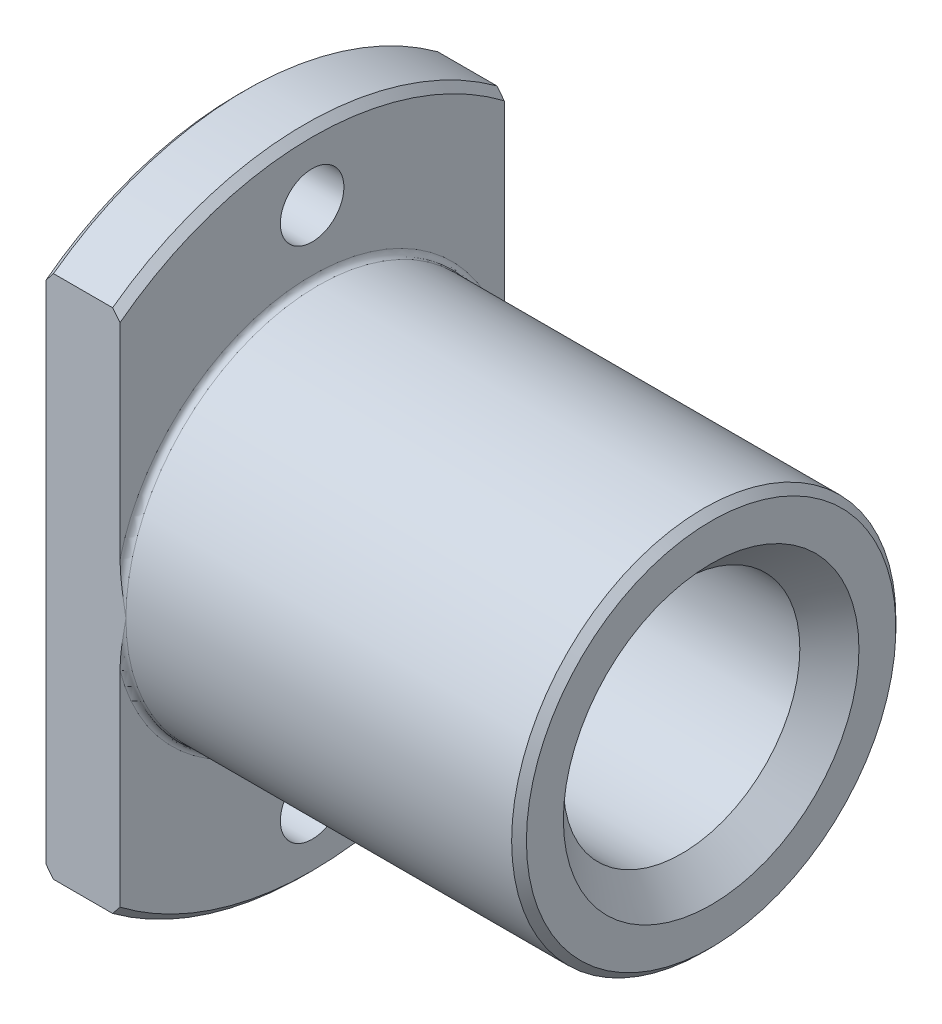
ISO-10303-21;
HEADER;
FILE_DESCRIPTION(('STEP AP214'),'2;1');
FILE_NAME('part.step','',(''),(''),'','','');
FILE_SCHEMA(('AUTOMOTIVE_DESIGN { 1 0 10303 214 1 1 1 1 }'));
ENDSEC;
DATA;
#1=APPLICATION_CONTEXT('core data for automotive mechanical design processes');
#2=APPLICATION_PROTOCOL_DEFINITION('international standard','automotive_design',2000,#1);
#3=PRODUCT_CONTEXT('',#1,'mechanical');
#4=PRODUCT('Part','Part','',(#3));
#5=PRODUCT_RELATED_PRODUCT_CATEGORY('part','',(#4));
#6=PRODUCT_DEFINITION_FORMATION('','',#4);
#7=PRODUCT_DEFINITION_CONTEXT('part definition',#1,'design');
#8=PRODUCT_DEFINITION('design','',#6,#7);
#9=PRODUCT_DEFINITION_SHAPE('','',#8);
#10=(LENGTH_UNIT() NAMED_UNIT(*) SI_UNIT(.MILLI.,.METRE.));
#11=(NAMED_UNIT(*) PLANE_ANGLE_UNIT() SI_UNIT($,.RADIAN.));
#12=(NAMED_UNIT(*) SI_UNIT($,.STERADIAN.) SOLID_ANGLE_UNIT());
#13=UNCERTAINTY_MEASURE_WITH_UNIT(LENGTH_MEASURE(1.E-05),#10,'distance_accuracy_value','');
#14=(GEOMETRIC_REPRESENTATION_CONTEXT(3) GLOBAL_UNCERTAINTY_ASSIGNED_CONTEXT((#13)) GLOBAL_UNIT_ASSIGNED_CONTEXT((#10,
#11,#12)) REPRESENTATION_CONTEXT('',''));
#15=CARTESIAN_POINT('',(0.,0.,0.));
#16=DIRECTION('',(0.,0.,1.));
#17=DIRECTION('',(1.,0.,0.));
#18=AXIS2_PLACEMENT_3D('',#15,#16,#17);
#19=CARTESIAN_POINT('',(16.,0.,0.));
#20=DIRECTION('',(1.,0.,0.));
#21=DIRECTION('',(0.,0.,-1.));
#22=AXIS2_PLACEMENT_3D('',#19,#20,#21);
#23=CYLINDRICAL_SURFACE('',#22,8.);
#24=CARTESIAN_POINT('',(30.,0.,0.));
#25=DIRECTION('',(1.,0.,0.));
#26=DIRECTION('',(0.,1.,0.));
#27=AXIS2_PLACEMENT_3D('',#24,#25,#26);
#28=CIRCLE('',#27,8.);
#29=CARTESIAN_POINT('',(30.,8.,0.));
#30=VERTEX_POINT('',#29);
#31=EDGE_CURVE('E170',#30,#30,#28,.T.);
#32=ORIENTED_EDGE('',*,*,#31,.T.);
#33=EDGE_LOOP('',(#32));
#34=FACE_BOUND('',#33,.T.);
#35=CARTESIAN_POINT('',(2.,0.,0.));
#36=DIRECTION('',(-1.,0.,0.));
#37=DIRECTION('',(0.,1.,0.));
#38=AXIS2_PLACEMENT_3D('',#35,#36,#37);
#39=CIRCLE('',#38,8.);
#40=CARTESIAN_POINT('',(2.,8.,0.));
#41=VERTEX_POINT('',#40);
#42=EDGE_CURVE('E114',#41,#41,#39,.T.);
#43=ORIENTED_EDGE('',*,*,#42,.T.);
#44=EDGE_LOOP('',(#43));
#45=FACE_BOUND('',#44,.T.);
#46=ADVANCED_FACE('F17',(#34,#45),#23,.F.);
#47=CARTESIAN_POINT('',(0.,0.,0.));
#48=DIRECTION('',(-1.,0.,0.));
#49=DIRECTION('',(0.,0.,1.));
#50=AXIS2_PLACEMENT_3D('',#47,#48,#49);
#51=CONICAL_SURFACE('',#50,10.,0.785398163397448);
#52=CARTESIAN_POINT('',(0.,0.,0.));
#53=DIRECTION('',(-1.,0.,0.));
#54=DIRECTION('',(0.,0.,1.));
#55=AXIS2_PLACEMENT_3D('',#52,#53,#54);
#56=CIRCLE('',#55,10.);
#57=CARTESIAN_POINT('',(0.,0.,10.));
#58=VERTEX_POINT('',#57);
#59=EDGE_CURVE('E213',#58,#58,#56,.F.);
#60=ORIENTED_EDGE('',*,*,#59,.F.);
#61=EDGE_LOOP('',(#60));
#62=FACE_BOUND('',#61,.T.);
#63=ORIENTED_EDGE('',*,*,#42,.F.);
#64=EDGE_LOOP('',(#63));
#65=FACE_BOUND('',#64,.T.);
#66=ADVANCED_FACE('F265',(#62,#65),#51,.F.);
#67=CARTESIAN_POINT('',(0.49999999999998,0.,0.));
#68=DIRECTION('',(1.,0.,0.));
#69=DIRECTION('',(0.,0.,-1.));
#70=AXIS2_PLACEMENT_3D('',#67,#68,#69);
#71=CONICAL_SURFACE('',#70,22.,0.785398163397448);
#72=CARTESIAN_POINT('',(0.,-17.1245437895437,-13.));
#73=CARTESIAN_POINT('',(0.0830091371064529,-17.2287529536946,-13.));
#74=CARTESIAN_POINT('',(0.166180373495549,-17.3328321671988,-13.));
#75=CARTESIAN_POINT('',(0.332847040180335,-17.5407306871027,-13.));
#76=CARTESIAN_POINT('',(0.4163424704579,-17.6445499935168,-13.));
#77=CARTESIAN_POINT('',(0.499999999999983,-17.7482393492988,-13.));
#78=B_SPLINE_CURVE_WITH_KNOTS('',3,(#72,#73,#74,#75,#76,#77),.UNSPECIFIED.,.F.,.F.,(4,2,4),(0.,
0.399686671300564,0.799373320256933),.UNSPECIFIED.);
#79=CARTESIAN_POINT('',(0.,-17.1245437895437,-13.));
#80=VERTEX_POINT('',#79);
#81=CARTESIAN_POINT('',(0.499999999999991,-17.7482393492988,-13.));
#82=VERTEX_POINT('',#81);
#83=EDGE_CURVE('E248',#80,#82,#78,.T.);
#84=ORIENTED_EDGE('',*,*,#83,.T.);
#85=CARTESIAN_POINT('',(0.5,0.,0.));
#86=DIRECTION('',(1.,0.,0.));
#87=DIRECTION('',(0.,0.,-1.));
#88=AXIS2_PLACEMENT_3D('',#85,#86,#87);
#89=CIRCLE('',#88,22.);
#90=CARTESIAN_POINT('',(0.499999999999989,-17.7482393492988,13.));
#91=VERTEX_POINT('',#90);
#92=EDGE_CURVE('E103',#91,#82,#89,.T.);
#93=ORIENTED_EDGE('',*,*,#92,.F.);
#94=CARTESIAN_POINT('',(0.499999999999979,-17.7482393492988,13.));
#95=CARTESIAN_POINT('',(0.416342470457896,-17.6445499935168,13.));
#96=CARTESIAN_POINT('',(0.332847040180329,-17.5407306871027,13.));
#97=CARTESIAN_POINT('',(0.166180373495543,-17.3328321671988,13.));
#98=CARTESIAN_POINT('',(0.0830091371064473,-17.2287529536946,13.));
#99=CARTESIAN_POINT('',(0.,-17.1245437895437,13.));
#100=B_SPLINE_CURVE_WITH_KNOTS('',3,(#94,#95,#96,#97,#98,#99),.UNSPECIFIED.,.F.,.F.,(4,2,4),(0.,
0.399686648956371,0.799373320256931),.UNSPECIFIED.);
#101=CARTESIAN_POINT('',(0.,-17.1245437895437,13.));
#102=VERTEX_POINT('',#101);
#103=EDGE_CURVE('E20',#91,#102,#100,.T.);
#104=ORIENTED_EDGE('',*,*,#103,.T.);
#105=CARTESIAN_POINT('',(0.,0.,0.));
#106=DIRECTION('',(1.,0.,0.));
#107=DIRECTION('',(0.,0.,-1.));
#108=AXIS2_PLACEMENT_3D('',#105,#106,#107);
#109=CIRCLE('',#108,21.5);
#110=EDGE_CURVE('E107',#80,#102,#109,.F.);
#111=ORIENTED_EDGE('',*,*,#110,.F.);
#112=EDGE_LOOP('',(#84,#93,#104,#111));
#113=FACE_BOUND('',#112,.T.);
#114=ADVANCED_FACE('F106',(#113),#71,.T.);
#115=CARTESIAN_POINT('',(0.500000000000001,0.,0.));
#116=DIRECTION('',(1.,0.,0.));
#117=DIRECTION('',(0.,0.,-1.));
#118=AXIS2_PLACEMENT_3D('',#115,#116,#117);
#119=CONICAL_SURFACE('',#118,22.,0.785398163397447);
#120=CARTESIAN_POINT('',(0.499999999999981,17.7482393492988,-13.));
#121=CARTESIAN_POINT('',(0.416342470457898,17.6445499935168,-13.));
#122=CARTESIAN_POINT('',(0.332847040180332,17.5407306871027,-13.));
#123=CARTESIAN_POINT('',(0.166180373495547,17.3328321671988,-13.));
#124=CARTESIAN_POINT('',(0.0830091371064509,17.2287529536946,-13.));
#125=CARTESIAN_POINT('',(0.,17.1245437895437,-13.));
#126=B_SPLINE_CURVE_WITH_KNOTS('',3,(#120,#121,#122,#123,#124,#125),.UNSPECIFIED.,.F.,.F.,(4,2,
4),(0.,0.39968664895637,0.79937332025693),.UNSPECIFIED.);
#127=CARTESIAN_POINT('',(0.49999999999999,17.7482393492988,-13.));
#128=VERTEX_POINT('',#127);
#129=CARTESIAN_POINT('',(0.,17.1245437895437,-13.));
#130=VERTEX_POINT('',#129);
#131=EDGE_CURVE('E174',#128,#130,#126,.T.);
#132=ORIENTED_EDGE('',*,*,#131,.T.);
#133=CARTESIAN_POINT('',(0.,0.,0.));
#134=DIRECTION('',(1.,0.,0.));
#135=DIRECTION('',(0.,0.,-1.));
#136=AXIS2_PLACEMENT_3D('',#133,#134,#135);
#137=CIRCLE('',#136,21.5);
#138=CARTESIAN_POINT('',(0.,17.1245437895437,13.));
#139=VERTEX_POINT('',#138);
#140=EDGE_CURVE('E124',#139,#130,#137,.F.);
#141=ORIENTED_EDGE('',*,*,#140,.F.);
#142=CARTESIAN_POINT('',(0.,17.1245437895437,13.));
#143=CARTESIAN_POINT('',(0.0830091371064499,17.2287529536946,13.));
#144=CARTESIAN_POINT('',(0.166180373495545,17.3328321671988,13.));
#145=CARTESIAN_POINT('',(0.33284704018033,17.5407306871027,13.));
#146=CARTESIAN_POINT('',(0.416342470457896,17.6445499935168,13.));
#147=CARTESIAN_POINT('',(0.49999999999998,17.7482393492988,13.));
#148=B_SPLINE_CURVE_WITH_KNOTS('',3,(#142,#143,#144,#145,#146,#147),.UNSPECIFIED.,.F.,.F.,(4,2,
4),(0.,0.399686671300559,0.799373320256933),.UNSPECIFIED.);
#149=CARTESIAN_POINT('',(0.499999999999989,17.7482393492988,13.));
#150=VERTEX_POINT('',#149);
#151=EDGE_CURVE('E113',#139,#150,#148,.T.);
#152=ORIENTED_EDGE('',*,*,#151,.T.);
#153=CARTESIAN_POINT('',(0.5,0.,0.));
#154=DIRECTION('',(1.,0.,0.));
#155=DIRECTION('',(0.,0.,-1.));
#156=AXIS2_PLACEMENT_3D('',#153,#154,#155);
#157=CIRCLE('',#156,22.);
#158=EDGE_CURVE('E150',#128,#150,#157,.T.);
#159=ORIENTED_EDGE('',*,*,#158,.F.);
#160=EDGE_LOOP('',(#132,#141,#152,#159));
#161=FACE_BOUND('',#160,.T.);
#162=ADVANCED_FACE('F256',(#161),#119,.T.);
#163=CARTESIAN_POINT('',(32.,0.,0.));
#164=DIRECTION('',(1.,0.,0.));
#165=DIRECTION('',(0.,0.,-1.));
#166=AXIS2_PLACEMENT_3D('',#163,#164,#165);
#167=CONICAL_SURFACE('',#166,10.,0.785398163397448);
#168=CARTESIAN_POINT('',(32.,0.,0.));
#169=DIRECTION('',(1.,0.,0.));
#170=DIRECTION('',(0.,0.,-1.));
#171=AXIS2_PLACEMENT_3D('',#168,#169,#170);
#172=CIRCLE('',#171,10.);
#173=CARTESIAN_POINT('',(32.,0.,-10.));
#174=VERTEX_POINT('',#173);
#175=EDGE_CURVE('E160',#174,#174,#172,.F.);
#176=ORIENTED_EDGE('',*,*,#175,.F.);
#177=EDGE_LOOP('',(#176));
#178=FACE_BOUND('',#177,.T.);
#179=ORIENTED_EDGE('',*,*,#31,.F.);
#180=EDGE_LOOP('',(#179));
#181=FACE_BOUND('',#180,.T.);
#182=ADVANCED_FACE('F260',(#178,#181),#167,.F.);
#183=CARTESIAN_POINT('',(4.5,0.,0.));
#184=DIRECTION('',(-1.,0.,0.));
#185=DIRECTION('',(0.,0.,1.));
#186=AXIS2_PLACEMENT_3D('',#183,#184,#185);
#187=CONICAL_SURFACE('',#186,22.,0.785398163397447);
#188=CARTESIAN_POINT('',(4.50000000000002,-17.7482393492988,-13.));
#189=CARTESIAN_POINT('',(4.5836575295421,-17.6445499935168,-13.));
#190=CARTESIAN_POINT('',(4.66715295981967,-17.5407306871027,-13.));
#191=CARTESIAN_POINT('',(4.83381962650446,-17.3328321671988,-13.));
#192=CARTESIAN_POINT('',(4.91699086289355,-17.2287529536946,-13.));
#193=CARTESIAN_POINT('',(5.00000000000001,-17.1245437895437,-13.));
#194=B_SPLINE_CURVE_WITH_KNOTS('',3,(#188,#189,#190,#191,#192,#193),.UNSPECIFIED.,.F.,.F.,(4,2,
4),(0.,0.399686648956371,0.799373320256932),.UNSPECIFIED.);
#195=CARTESIAN_POINT('',(4.50000000000001,-17.7482393492988,-13.));
#196=VERTEX_POINT('',#195);
#197=CARTESIAN_POINT('',(5.,-17.1245437895437,-13.));
#198=VERTEX_POINT('',#197);
#199=EDGE_CURVE('E214',#196,#198,#194,.T.);
#200=ORIENTED_EDGE('',*,*,#199,.T.);
#201=CARTESIAN_POINT('',(5.,0.,0.));
#202=DIRECTION('',(-1.,0.,0.));
#203=DIRECTION('',(0.,0.,1.));
#204=AXIS2_PLACEMENT_3D('',#201,#202,#203);
#205=CIRCLE('',#204,21.5);
#206=CARTESIAN_POINT('',(5.,-17.1245437895437,13.));
#207=VERTEX_POINT('',#206);
#208=EDGE_CURVE('E283',#207,#198,#205,.F.);
#209=ORIENTED_EDGE('',*,*,#208,.F.);
#210=CARTESIAN_POINT('',(5.00000000000001,-17.1245437895437,13.));
#211=CARTESIAN_POINT('',(4.91699086289355,-17.2287529536946,13.));
#212=CARTESIAN_POINT('',(4.83381962650446,-17.3328321671988,13.));
#213=CARTESIAN_POINT('',(4.66715295981967,-17.5407306871027,13.));
#214=CARTESIAN_POINT('',(4.5836575295421,-17.6445499935168,13.));
#215=CARTESIAN_POINT('',(4.50000000000002,-17.7482393492988,13.));
#216=B_SPLINE_CURVE_WITH_KNOTS('',3,(#210,#211,#212,#213,#214,#215),.UNSPECIFIED.,.F.,.F.,(4,2,
4),(0.,0.39968667130056,0.799373320256934),.UNSPECIFIED.);
#217=CARTESIAN_POINT('',(4.50000000000001,-17.7482393492988,13.));
#218=VERTEX_POINT('',#217);
#219=EDGE_CURVE('E173',#207,#218,#216,.T.);
#220=ORIENTED_EDGE('',*,*,#219,.T.);
#221=CARTESIAN_POINT('',(4.5,0.,0.));
#222=DIRECTION('',(1.,0.,0.));
#223=DIRECTION('',(0.,0.,-1.));
#224=AXIS2_PLACEMENT_3D('',#221,#222,#223);
#225=CIRCLE('',#224,22.);
#226=EDGE_CURVE('E151',#196,#218,#225,.F.);
#227=ORIENTED_EDGE('',*,*,#226,.F.);
#228=EDGE_LOOP('',(#200,#209,#220,#227));
#229=FACE_BOUND('',#228,.T.);
#230=ADVANCED_FACE('F281',(#229),#187,.T.);
#231=CARTESIAN_POINT('',(2.5,-17.5,0.));
#232=DIRECTION('',(1.,0.,0.));
#233=DIRECTION('',(0.,0.,-1.));
#234=AXIS2_PLACEMENT_3D('',#231,#232,#233);
#235=CYLINDRICAL_SURFACE('',#234,2.15);
#236=CARTESIAN_POINT('',(5.,-17.5,0.));
#237=DIRECTION('',(1.,0.,0.));
#238=DIRECTION('',(0.,0.,-1.));
#239=AXIS2_PLACEMENT_3D('',#236,#237,#238);
#240=CIRCLE('',#239,2.15);
#241=CARTESIAN_POINT('',(5.,-17.5,-2.15));
#242=VERTEX_POINT('',#241);
#243=EDGE_CURVE('E146',#242,#242,#240,.F.);
#244=ORIENTED_EDGE('',*,*,#243,.F.);
#245=EDGE_LOOP('',(#244));
#246=FACE_BOUND('',#245,.T.);
#247=CARTESIAN_POINT('',(0.,-17.5,0.));
#248=DIRECTION('',(1.,0.,0.));
#249=DIRECTION('',(0.,0.,-1.));
#250=AXIS2_PLACEMENT_3D('',#247,#248,#249);
#251=CIRCLE('',#250,2.15);
#252=CARTESIAN_POINT('',(0.,-17.5,-2.15));
#253=VERTEX_POINT('',#252);
#254=EDGE_CURVE('E125',#253,#253,#251,.T.);
#255=ORIENTED_EDGE('',*,*,#254,.F.);
#256=EDGE_LOOP('',(#255));
#257=FACE_BOUND('',#256,.T.);
#258=ADVANCED_FACE('F467',(#246,#257),#235,.F.);
#259=CARTESIAN_POINT('',(2.5,17.5,0.));
#260=DIRECTION('',(1.,0.,0.));
#261=DIRECTION('',(0.,0.,-1.));
#262=AXIS2_PLACEMENT_3D('',#259,#260,#261);
#263=CYLINDRICAL_SURFACE('',#262,2.15);
#264=CARTESIAN_POINT('',(5.,17.5,0.));
#265=DIRECTION('',(1.,0.,0.));
#266=DIRECTION('',(0.,0.,-1.));
#267=AXIS2_PLACEMENT_3D('',#264,#265,#266);
#268=CIRCLE('',#267,2.15);
#269=CARTESIAN_POINT('',(5.,17.5,-2.15));
#270=VERTEX_POINT('',#269);
#271=EDGE_CURVE('E131',#270,#270,#268,.F.);
#272=ORIENTED_EDGE('',*,*,#271,.F.);
#273=EDGE_LOOP('',(#272));
#274=FACE_BOUND('',#273,.T.);
#275=CARTESIAN_POINT('',(0.,17.5,0.));
#276=DIRECTION('',(1.,0.,0.));
#277=DIRECTION('',(0.,0.,-1.));
#278=AXIS2_PLACEMENT_3D('',#275,#276,#277);
#279=CIRCLE('',#278,2.15);
#280=CARTESIAN_POINT('',(0.,17.5,-2.15));
#281=VERTEX_POINT('',#280);
#282=EDGE_CURVE('E444',#281,#281,#279,.T.);
#283=ORIENTED_EDGE('',*,*,#282,.F.);
#284=EDGE_LOOP('',(#283));
#285=FACE_BOUND('',#284,.T.);
#286=ADVANCED_FACE('F200',(#274,#285),#263,.F.);
#287=CARTESIAN_POINT('',(4.5,0.,0.));
#288=DIRECTION('',(-1.,0.,0.));
#289=DIRECTION('',(0.,0.,1.));
#290=AXIS2_PLACEMENT_3D('',#287,#288,#289);
#291=CONICAL_SURFACE('',#290,22.,0.785398163397447);
#292=CARTESIAN_POINT('',(4.50000000000002,17.7482393492988,13.));
#293=CARTESIAN_POINT('',(4.5836575295421,17.6445499935168,13.));
#294=CARTESIAN_POINT('',(4.66715295981967,17.5407306871027,13.));
#295=CARTESIAN_POINT('',(4.83381962650446,17.3328321671988,13.));
#296=CARTESIAN_POINT('',(4.91699086289355,17.2287529536946,13.));
#297=CARTESIAN_POINT('',(5.00000000000001,17.1245437895437,13.));
#298=B_SPLINE_CURVE_WITH_KNOTS('',3,(#292,#293,#294,#295,#296,#297),.UNSPECIFIED.,.F.,.F.,(4,2,
4),(0.,0.399686648956371,0.799373320256932),.UNSPECIFIED.);
#299=CARTESIAN_POINT('',(4.50000000000002,17.7482393492988,13.));
#300=VERTEX_POINT('',#299);
#301=CARTESIAN_POINT('',(5.,17.1245437895437,13.));
#302=VERTEX_POINT('',#301);
#303=EDGE_CURVE('E145',#300,#302,#298,.T.);
#304=ORIENTED_EDGE('',*,*,#303,.T.);
#305=CARTESIAN_POINT('',(5.,0.,0.));
#306=DIRECTION('',(-1.,0.,0.));
#307=DIRECTION('',(0.,0.,1.));
#308=AXIS2_PLACEMENT_3D('',#305,#306,#307);
#309=CIRCLE('',#308,21.5);
#310=CARTESIAN_POINT('',(5.,17.1245437895437,-13.));
#311=VERTEX_POINT('',#310);
#312=EDGE_CURVE('E135',#311,#302,#309,.F.);
#313=ORIENTED_EDGE('',*,*,#312,.F.);
#314=CARTESIAN_POINT('',(5.00000000000001,17.1245437895437,-13.));
#315=CARTESIAN_POINT('',(4.91699086289355,17.2287529536946,-13.));
#316=CARTESIAN_POINT('',(4.83381962650446,17.3328321671988,-13.));
#317=CARTESIAN_POINT('',(4.66715295981967,17.5407306871027,-13.));
#318=CARTESIAN_POINT('',(4.5836575295421,17.6445499935168,-13.));
#319=CARTESIAN_POINT('',(4.50000000000002,17.7482393492988,-13.));
#320=B_SPLINE_CURVE_WITH_KNOTS('',3,(#314,#315,#316,#317,#318,#319),.UNSPECIFIED.,.F.,.F.,(4,2,
4),(0.,0.39968667130056,0.799373320256934),.UNSPECIFIED.);
#321=CARTESIAN_POINT('',(4.50000000000001,17.7482393492988,-13.));
#322=VERTEX_POINT('',#321);
#323=EDGE_CURVE('E206',#311,#322,#320,.T.);
#324=ORIENTED_EDGE('',*,*,#323,.T.);
#325=CARTESIAN_POINT('',(4.5,0.,0.));
#326=DIRECTION('',(1.,0.,0.));
#327=DIRECTION('',(0.,0.,-1.));
#328=AXIS2_PLACEMENT_3D('',#325,#326,#327);
#329=CIRCLE('',#328,22.);
#330=EDGE_CURVE('E147',#300,#322,#329,.F.);
#331=ORIENTED_EDGE('',*,*,#330,.F.);
#332=EDGE_LOOP('',(#304,#313,#324,#331));
#333=FACE_BOUND('',#332,.T.);
#334=ADVANCED_FACE('F195',(#333),#291,.T.);
#335=CARTESIAN_POINT('',(0.,10.75,0.));
#336=DIRECTION('',(-1.,0.,0.));
#337=DIRECTION('',(0.,0.,1.));
#338=AXIS2_PLACEMENT_3D('',#335,#336,#337);
#339=PLANE('',#338);
#340=DIRECTION('',(0.,1.,0.));
#341=VECTOR('',#340,1.);
#342=CARTESIAN_POINT('',(0.,22.,13.));
#343=LINE('',#342,#341);
#344=EDGE_CURVE('E121',#102,#139,#343,.T.);
#345=ORIENTED_EDGE('',*,*,#344,.T.);
#346=ORIENTED_EDGE('',*,*,#140,.T.);
#347=DIRECTION('',(0.,1.,0.));
#348=VECTOR('',#347,1.);
#349=CARTESIAN_POINT('',(0.,-22.,-13.));
#350=LINE('',#349,#348);
#351=EDGE_CURVE('E123',#130,#80,#350,.F.);
#352=ORIENTED_EDGE('',*,*,#351,.T.);
#353=ORIENTED_EDGE('',*,*,#110,.T.);
#354=EDGE_LOOP('',(#345,#346,#352,#353));
#355=FACE_BOUND('',#354,.T.);
#356=ORIENTED_EDGE('',*,*,#254,.T.);
#357=EDGE_LOOP('',(#356));
#358=FACE_BOUND('',#357,.T.);
#359=ORIENTED_EDGE('',*,*,#282,.T.);
#360=EDGE_LOOP('',(#359));
#361=FACE_BOUND('',#360,.T.);
#362=ORIENTED_EDGE('',*,*,#59,.T.);
#363=EDGE_LOOP('',(#362));
#364=FACE_BOUND('',#363,.T.);
#365=ADVANCED_FACE('F118',(#355,#358,#361,#364),#339,.T.);
#366=CARTESIAN_POINT('',(2.5,0.,0.));
#367=DIRECTION('',(1.,0.,0.));
#368=DIRECTION('',(0.,0.,-1.));
#369=AXIS2_PLACEMENT_3D('',#366,#367,#368);
#370=CYLINDRICAL_SURFACE('',#369,22.);
#371=DIRECTION('',(1.,0.,0.));
#372=VECTOR('',#371,1.);
#373=CARTESIAN_POINT('',(0.,-17.7482393492988,-13.));
#374=LINE('',#373,#372);
#375=EDGE_CURVE('E166',#82,#196,#374,.T.);
#376=ORIENTED_EDGE('',*,*,#375,.T.);
#377=ORIENTED_EDGE('',*,*,#226,.T.);
#378=DIRECTION('',(-1.,0.,0.));
#379=VECTOR('',#378,1.);
#380=CARTESIAN_POINT('',(0.,-17.7482393492988,13.));
#381=LINE('',#380,#379);
#382=EDGE_CURVE('E132',#218,#91,#381,.T.);
#383=ORIENTED_EDGE('',*,*,#382,.T.);
#384=ORIENTED_EDGE('',*,*,#92,.T.);
#385=EDGE_LOOP('',(#376,#377,#383,#384));
#386=FACE_BOUND('',#385,.T.);
#387=ADVANCED_FACE('F274',(#386),#370,.T.);
#388=CARTESIAN_POINT('',(2.5,0.,0.));
#389=DIRECTION('',(1.,0.,0.));
#390=DIRECTION('',(0.,0.,-1.));
#391=AXIS2_PLACEMENT_3D('',#388,#389,#390);
#392=CYLINDRICAL_SURFACE('',#391,22.);
#393=DIRECTION('',(1.,0.,0.));
#394=VECTOR('',#393,1.);
#395=CARTESIAN_POINT('',(0.,17.7482393492988,-13.));
#396=LINE('',#395,#394);
#397=EDGE_CURVE('E154',#322,#128,#396,.F.);
#398=ORIENTED_EDGE('',*,*,#397,.T.);
#399=ORIENTED_EDGE('',*,*,#158,.T.);
#400=DIRECTION('',(-1.,0.,0.));
#401=VECTOR('',#400,1.);
#402=CARTESIAN_POINT('',(0.,17.7482393492988,13.));
#403=LINE('',#402,#401);
#404=EDGE_CURVE('E142',#150,#300,#403,.F.);
#405=ORIENTED_EDGE('',*,*,#404,.T.);
#406=ORIENTED_EDGE('',*,*,#330,.T.);
#407=EDGE_LOOP('',(#398,#399,#405,#406));
#408=FACE_BOUND('',#407,.T.);
#409=ADVANCED_FACE('F315',(#408),#392,.T.);
#410=CARTESIAN_POINT('',(32.,6.25,0.));
#411=DIRECTION('',(1.,0.,0.));
#412=DIRECTION('',(0.,0.,-1.));
#413=AXIS2_PLACEMENT_3D('',#410,#411,#412);
#414=PLANE('',#413);
#415=CARTESIAN_POINT('',(32.,0.,0.));
#416=DIRECTION('',(-1.,0.,0.));
#417=DIRECTION('',(0.,0.,1.));
#418=AXIS2_PLACEMENT_3D('',#415,#416,#417);
#419=CIRCLE('',#418,12.5);
#420=CARTESIAN_POINT('',(32.,0.,12.5));
#421=VERTEX_POINT('',#420);
#422=EDGE_CURVE('E157',#421,#421,#419,.T.);
#423=ORIENTED_EDGE('',*,*,#422,.F.);
#424=EDGE_LOOP('',(#423));
#425=FACE_BOUND('',#424,.T.);
#426=ORIENTED_EDGE('',*,*,#175,.T.);
#427=EDGE_LOOP('',(#426));
#428=FACE_BOUND('',#427,.T.);
#429=ADVANCED_FACE('F311',(#425,#428),#414,.T.);
#430=CARTESIAN_POINT('',(5.,17.45,0.));
#431=DIRECTION('',(1.,0.,0.));
#432=DIRECTION('',(0.,0.,-1.));
#433=AXIS2_PLACEMENT_3D('',#430,#431,#432);
#434=PLANE('',#433);
#435=ORIENTED_EDGE('',*,*,#243,.T.);
#436=EDGE_LOOP('',(#435));
#437=FACE_BOUND('',#436,.T.);
#438=DIRECTION('',(0.,1.,0.));
#439=VECTOR('',#438,1.);
#440=CARTESIAN_POINT('',(5.,22.,13.));
#441=LINE('',#440,#439);
#442=CARTESIAN_POINT('',(5.,-3.24961536185438,13.));
#443=VERTEX_POINT('',#442);
#444=EDGE_CURVE('E137',#443,#207,#441,.F.);
#445=ORIENTED_EDGE('',*,*,#444,.T.);
#446=ORIENTED_EDGE('',*,*,#208,.T.);
#447=DIRECTION('',(0.,1.,0.));
#448=VECTOR('',#447,1.);
#449=CARTESIAN_POINT('',(5.,-22.,-13.));
#450=LINE('',#449,#448);
#451=CARTESIAN_POINT('',(5.,-3.24961536185438,-13.));
#452=VERTEX_POINT('',#451);
#453=EDGE_CURVE('E168',#198,#452,#450,.T.);
#454=ORIENTED_EDGE('',*,*,#453,.T.);
#455=CARTESIAN_POINT('',(5.,0.,0.));
#456=DIRECTION('',(1.,0.,0.));
#457=DIRECTION('',(0.,-0.242508609093611,0.970149253731343));
#458=AXIS2_PLACEMENT_3D('',#455,#456,#457);
#459=CIRCLE('',#458,13.4);
#460=EDGE_CURVE('E182',#452,#443,#459,.F.);
#461=ORIENTED_EDGE('',*,*,#460,.T.);
#462=EDGE_LOOP('',(#445,#446,#454,#461));
#463=FACE_BOUND('',#462,.T.);
#464=ADVANCED_FACE('F289',(#437,#463),#434,.T.);
#465=CARTESIAN_POINT('',(0.,22.,13.));
#466=DIRECTION('',(0.,0.,-1.));
#467=DIRECTION('',(-1.,0.,0.));
#468=AXIS2_PLACEMENT_3D('',#465,#466,#467);
#469=PLANE('',#468);
#470=ORIENTED_EDGE('',*,*,#344,.F.);
#471=ORIENTED_EDGE('',*,*,#103,.F.);
#472=ORIENTED_EDGE('',*,*,#382,.F.);
#473=ORIENTED_EDGE('',*,*,#219,.F.);
#474=ORIENTED_EDGE('',*,*,#444,.F.);
#475=CARTESIAN_POINT('',(5.4,0.,13.));
#476=CARTESIAN_POINT('',(5.37006605510488,-0.170585754090153,12.9999645803027));
#477=CARTESIAN_POINT('',(5.34002398446141,-0.341160445674433,13.000003598834));
#478=CARTESIAN_POINT('',(5.28526345897468,-0.658551041566375,13.0000930560647));
#479=CARTESIAN_POINT('',(5.26038974676959,-0.805340406595837,13.0001411223467));
#480=CARTESIAN_POINT('',(5.2163259363252,-1.07525008244893,13.0001655001162));
#481=CARTESIAN_POINT('',(5.19687047505832,-1.19832644473589,13.0001522350998));
#482=CARTESIAN_POINT('',(5.1632357456468,-1.42064610894258,13.0000728044016));
#483=CARTESIAN_POINT('',(5.14876845140025,-1.51984604618526,13.0000174847271));
#484=CARTESIAN_POINT('',(5.11286814501409,-1.77730978764027,12.999972156418));
#485=CARTESIAN_POINT('',(5.09239249493448,-1.93571132387891,13.0000403383428));
#486=CARTESIAN_POINT('',(5.05804316013975,-2.2377398681298,13.0001561704157));
#487=CARTESIAN_POINT('',(5.04372264439398,-2.3813150583372,13.0002051681094));
#488=CARTESIAN_POINT('',(5.02158850518207,-2.65343267687984,13.0002095737854));
#489=CARTESIAN_POINT('',(5.01324027828029,-2.78192913967816,13.0001744910747));
#490=CARTESIAN_POINT('',(5.00280972283556,-3.02349106727021,13.0000881463802));
#491=CARTESIAN_POINT('',(5.00008811789565,-3.13652998449335,13.0000393751297));
#492=CARTESIAN_POINT('',(5.,-3.24961536185439,13.));
#493=B_SPLINE_CURVE_WITH_KNOTS('',3,(#475,#476,#477,#478,#479,#480,#481,#482,#483,#484,#485,
#486,#487,#488,#489,#490,#491,#492),.UNSPECIFIED.,.F.,.F.,(4,2,2,2,2,2,2,2,4),(0.,
0.519589692098512,0.966231630533148,1.34003479480129,1.64077916492354,2.11988333383099,
2.55267869950803,2.93887225300003,3.27803309570285),.UNSPECIFIED.);
#494=CARTESIAN_POINT('',(5.4,0.,13.));
#495=VERTEX_POINT('',#494);
#496=EDGE_CURVE('E378',#443,#495,#493,.F.);
#497=ORIENTED_EDGE('',*,*,#496,.T.);
#498=CARTESIAN_POINT('',(5.,3.24961536185438,13.));
#499=CARTESIAN_POINT('',(5.00008811302473,3.13652652759424,13.0000393355284));
#500=CARTESIAN_POINT('',(5.00280990064895,3.02348415919911,13.0000880180062));
#501=CARTESIAN_POINT('',(5.01324100915183,2.78191767655627,13.0001741598065));
#502=CARTESIAN_POINT('',(5.02158952372839,2.65342010733384,13.0002091272021));
#503=CARTESIAN_POINT('',(5.0437241082257,2.38130257157122,13.0002046025238));
#504=CARTESIAN_POINT('',(5.05804469723455,2.23772856449472,13.0001556178531));
#505=CARTESIAN_POINT('',(5.09239364585516,1.93570458720567,13.0000400003619));
#506=CARTESIAN_POINT('',(5.11286873979295,1.77730642372523,12.9999720401252));
#507=CARTESIAN_POINT('',(5.14876955703539,1.51983755095125,13.000017559602));
#508=CARTESIAN_POINT('',(5.16323807470706,1.42062913412605,13.0000729206982));
#509=CARTESIAN_POINT('',(5.19687465770773,1.19829822492416,13.0001523647401));
#510=CARTESIAN_POINT('',(5.21633071443922,1.07521909237972,13.0001655868873));
#511=CARTESIAN_POINT('',(5.26039483014229,0.805309501640412,13.0001411446111));
#512=CARTESIAN_POINT('',(5.28526817869645,0.658522980191377,13.0000930652651));
#513=CARTESIAN_POINT('',(5.3400269259337,0.341143640906377,13.0000035997987));
#514=CARTESIAN_POINT('',(5.37006752869395,0.170577353350439,12.9999645885847));
#515=CARTESIAN_POINT('',(5.4,0.,13.));
#516=B_SPLINE_CURVE_WITH_KNOTS('',3,(#498,#499,#500,#501,#502,#503,#504,#505,#506,#507,#508,
#509,#510,#511,#512,#513,#514,#515),.UNSPECIFIED.,.F.,.F.,(4,2,2,2,2,2,2,2,4),(0.,
0.339171201873252,0.725368120234522,1.15815998350484,1.63725391167646,1.93802398119449,
2.31183563254116,2.75846897877224,3.27803308015197),.UNSPECIFIED.);
#517=CARTESIAN_POINT('',(5.,3.24961536185438,13.));
#518=VERTEX_POINT('',#517);
#519=EDGE_CURVE('E350',#495,#518,#516,.F.);
#520=ORIENTED_EDGE('',*,*,#519,.T.);
#521=DIRECTION('',(0.,1.,0.));
#522=VECTOR('',#521,1.);
#523=CARTESIAN_POINT('',(5.,17.45,13.));
#524=LINE('',#523,#522);
#525=EDGE_CURVE('E184',#302,#518,#524,.F.);
#526=ORIENTED_EDGE('',*,*,#525,.F.);
#527=ORIENTED_EDGE('',*,*,#303,.F.);
#528=ORIENTED_EDGE('',*,*,#404,.F.);
#529=ORIENTED_EDGE('',*,*,#151,.F.);
#530=EDGE_LOOP('',(#470,#471,#472,#473,#474,#497,#520,#526,#527,#528,#529));
#531=FACE_BOUND('',#530,.T.);
#532=ADVANCED_FACE('F128',(#531),#469,.F.);
#533=CARTESIAN_POINT('',(5.,17.45,0.));
#534=DIRECTION('',(1.,0.,0.));
#535=DIRECTION('',(0.,0.,-1.));
#536=AXIS2_PLACEMENT_3D('',#533,#534,#535);
#537=PLANE('',#536);
#538=ORIENTED_EDGE('',*,*,#525,.T.);
#539=CARTESIAN_POINT('',(5.,0.,0.));
#540=DIRECTION('',(1.,0.,0.));
#541=DIRECTION('',(0.,0.24250860909361,-0.970149253731343));
#542=AXIS2_PLACEMENT_3D('',#539,#540,#541);
#543=CIRCLE('',#542,13.4);
#544=CARTESIAN_POINT('',(5.,3.24961536185438,-13.));
#545=VERTEX_POINT('',#544);
#546=EDGE_CURVE('E418',#518,#545,#543,.F.);
#547=ORIENTED_EDGE('',*,*,#546,.T.);
#548=DIRECTION('',(0.,1.,0.));
#549=VECTOR('',#548,1.);
#550=CARTESIAN_POINT('',(5.,-22.,-13.));
#551=LINE('',#550,#549);
#552=EDGE_CURVE('E158',#545,#311,#551,.T.);
#553=ORIENTED_EDGE('',*,*,#552,.T.);
#554=ORIENTED_EDGE('',*,*,#312,.T.);
#555=EDGE_LOOP('',(#538,#547,#553,#554));
#556=FACE_BOUND('',#555,.T.);
#557=ORIENTED_EDGE('',*,*,#271,.T.);
#558=EDGE_LOOP('',(#557));
#559=FACE_BOUND('',#558,.T.);
#560=ADVANCED_FACE('F226',(#556,#559),#537,.T.);
#561=CARTESIAN_POINT('',(0.,-22.,-13.));
#562=DIRECTION('',(0.,0.,1.));
#563=DIRECTION('',(1.,0.,0.));
#564=AXIS2_PLACEMENT_3D('',#561,#562,#563);
#565=PLANE('',#564);
#566=ORIENTED_EDGE('',*,*,#397,.F.);
#567=ORIENTED_EDGE('',*,*,#323,.F.);
#568=ORIENTED_EDGE('',*,*,#552,.F.);
#569=CARTESIAN_POINT('',(5.4,0.,-13.));
#570=CARTESIAN_POINT('',(5.37006605581772,0.170585750406408,-12.9999645803069));
#571=CARTESIAN_POINT('',(5.34002398586984,0.341160438302672,-13.0000035988193));
#572=CARTESIAN_POINT('',(5.28526346122322,0.658551029252509,-13.0000930560178));
#573=CARTESIAN_POINT('',(5.26038974919101,0.805340393032705,-13.0001411222863));
#574=CARTESIAN_POINT('',(5.21632593860581,1.07525006884583,-13.000165500059));
#575=CARTESIAN_POINT('',(5.19687047706249,1.1983264323481,-13.0001522350538));
#576=CARTESIAN_POINT('',(5.16323574676341,1.42064610148928,-13.000072804382));
#577=CARTESIAN_POINT('',(5.14876845192998,1.51984604245454,-13.0000174847202));
#578=CARTESIAN_POINT('',(5.11286814499971,1.77730978763456,-12.9999721564302));
#579=CARTESIAN_POINT('',(5.0923924949319,1.93571132387102,-13.0000403383455));
#580=CARTESIAN_POINT('',(5.05804316014489,2.23773986811791,-13.0001561704122));
#581=CARTESIAN_POINT('',(5.04372264439652,2.38131505832367,-13.0002051681081));
#582=CARTESIAN_POINT('',(5.02158850518235,2.65343267686598,-13.0002095737856));
#583=CARTESIAN_POINT('',(5.0132402782807,2.78192913966557,-13.0001744910747));
#584=CARTESIAN_POINT('',(5.00280972283609,3.02349106726269,-13.0000881463798));
#585=CARTESIAN_POINT('',(5.00008811789628,3.13652998448965,-13.0000393751291));
#586=CARTESIAN_POINT('',(5.,3.24961536185438,-13.));
#587=B_SPLINE_CURVE_WITH_KNOTS('',3,(#569,#570,#571,#572,#573,#574,#575,#576,#577,#578,#579,
#580,#581,#582,#583,#584,#585,#586),.UNSPECIFIED.,.F.,.F.,(4,2,2,2,2,2,2,2,4),(0.,
0.519589680841966,0.966231615495377,1.34003478349443,1.64077916492072,2.11988333381697,
2.55267869949019,2.93887225298586,3.27803309570001),.UNSPECIFIED.);
#588=CARTESIAN_POINT('',(5.4,0.,-13.));
#589=VERTEX_POINT('',#588);
#590=EDGE_CURVE('E40',#545,#589,#587,.F.);
#591=ORIENTED_EDGE('',*,*,#590,.T.);
#592=CARTESIAN_POINT('',(5.,-3.24961536185437,-13.));
#593=CARTESIAN_POINT('',(5.00008811302538,-3.1365265275856,-13.0000393355278));
#594=CARTESIAN_POINT('',(5.00280990064975,-3.02348415918172,-13.0000880180056));
#595=CARTESIAN_POINT('',(5.01324100915327,-2.78191767652728,-13.0001741598059));
#596=CARTESIAN_POINT('',(5.0215895237301,-2.653420107302,-13.0002091272017));
#597=CARTESIAN_POINT('',(5.04372410823036,-2.38130257153984,-13.0002046025215));
#598=CARTESIAN_POINT('',(5.05804469724199,-2.23772856446668,-13.0001556178488));
#599=CARTESIAN_POINT('',(5.09239364585411,-1.93570458718814,-13.0000400003642));
#600=CARTESIAN_POINT('',(5.112868739779,-1.77730642371464,-12.9999720401375));
#601=CARTESIAN_POINT('',(5.14876955758193,-1.51983754710114,-13.0000175595949));
#602=CARTESIAN_POINT('',(5.1632380758591,-1.42062912643421,-13.0000729206781));
#603=CARTESIAN_POINT('',(5.1968746597755,-1.19829821213988,-13.0001523646929));
#604=CARTESIAN_POINT('',(5.21633071679224,-1.07521907834121,-13.0001655868285));
#605=CARTESIAN_POINT('',(5.2603948326406,-0.805309487643149,-13.000141144549));
#606=CARTESIAN_POINT('',(5.28526818101639,-0.658522967483364,-13.0000930652168));
#607=CARTESIAN_POINT('',(5.34002692738683,-0.341143633298653,-13.0000035997835));
#608=CARTESIAN_POINT('',(5.3700675294294,-0.170577349548776,-12.999964588589));
#609=CARTESIAN_POINT('',(5.4,0.,-13.));
#610=B_SPLINE_CURVE_WITH_KNOTS('',3,(#592,#593,#594,#595,#596,#597,#598,#599,#600,#601,#602,
#603,#604,#605,#606,#607,#608,#609),.UNSPECIFIED.,.F.,.F.,(4,2,2,2,2,2,2,2,4),(0.,
0.339171201899398,0.725368120269155,1.15815998353063,1.63725391167641,1.9380239928602,
2.3118356480572,2.75846899038605,3.27803308014903),.UNSPECIFIED.);
#611=EDGE_CURVE('E388',#589,#452,#610,.F.);
#612=ORIENTED_EDGE('',*,*,#611,.T.);
#613=ORIENTED_EDGE('',*,*,#453,.F.);
#614=ORIENTED_EDGE('',*,*,#199,.F.);
#615=ORIENTED_EDGE('',*,*,#375,.F.);
#616=ORIENTED_EDGE('',*,*,#83,.F.);
#617=ORIENTED_EDGE('',*,*,#351,.F.);
#618=ORIENTED_EDGE('',*,*,#131,.F.);
#619=EDGE_LOOP('',(#566,#567,#568,#591,#612,#613,#614,#615,#616,#617,#618));
#620=FACE_BOUND('',#619,.T.);
#621=ADVANCED_FACE('F221',(#620),#565,.F.);
#622=CARTESIAN_POINT('',(31.5,0.,0.));
#623=DIRECTION('',(-1.,0.,0.));
#624=DIRECTION('',(0.,0.,1.));
#625=AXIS2_PLACEMENT_3D('',#622,#623,#624);
#626=CONICAL_SURFACE('',#625,13.,0.785398163397448);
#627=ORIENTED_EDGE('',*,*,#422,.T.);
#628=EDGE_LOOP('',(#627));
#629=FACE_BOUND('',#628,.T.);
#630=CARTESIAN_POINT('',(31.5,0.,0.));
#631=DIRECTION('',(1.,0.,0.));
#632=DIRECTION('',(0.,0.,-1.));
#633=AXIS2_PLACEMENT_3D('',#630,#631,#632);
#634=CIRCLE('',#633,13.);
#635=CARTESIAN_POINT('',(31.5,0.,-13.));
#636=VERTEX_POINT('',#635);
#637=EDGE_CURVE('E369',#636,#636,#634,.F.);
#638=ORIENTED_EDGE('',*,*,#637,.F.);
#639=EDGE_LOOP('',(#638));
#640=FACE_BOUND('',#639,.T.);
#641=ADVANCED_FACE('F225',(#629,#640),#626,.T.);
#642=CARTESIAN_POINT('',(5.4,0.,0.));
#643=DIRECTION('',(-1.,0.,0.));
#644=DIRECTION('',(0.,0.,1.));
#645=AXIS2_PLACEMENT_3D('',#642,#643,#644);
#646=TOROIDAL_SURFACE('',#645,13.4,0.400000000000001);
#647=CARTESIAN_POINT('',(5.4,0.,0.));
#648=DIRECTION('',(1.,0.,0.));
#649=DIRECTION('',(0.,0.,-1.));
#650=AXIS2_PLACEMENT_3D('',#647,#648,#649);
#651=CIRCLE('',#650,13.);
#652=EDGE_CURVE('E31',#495,#589,#651,.T.);
#653=ORIENTED_EDGE('',*,*,#652,.F.);
#654=ORIENTED_EDGE('',*,*,#496,.F.);
#655=ORIENTED_EDGE('',*,*,#460,.F.);
#656=ORIENTED_EDGE('',*,*,#611,.F.);
#657=EDGE_LOOP('',(#653,#654,#655,#656));
#658=FACE_BOUND('',#657,.T.);
#659=ADVANCED_FACE('F332',(#658),#646,.F.);
#660=CARTESIAN_POINT('',(5.4,0.,0.));
#661=DIRECTION('',(-1.,0.,0.));
#662=DIRECTION('',(0.,0.,1.));
#663=AXIS2_PLACEMENT_3D('',#660,#661,#662);
#664=TOROIDAL_SURFACE('',#663,13.4,0.400000000000001);
#665=ORIENTED_EDGE('',*,*,#546,.F.);
#666=ORIENTED_EDGE('',*,*,#519,.F.);
#667=CARTESIAN_POINT('',(5.4,0.,0.));
#668=DIRECTION('',(1.,0.,0.));
#669=DIRECTION('',(0.,0.,-1.));
#670=AXIS2_PLACEMENT_3D('',#667,#668,#669);
#671=CIRCLE('',#670,13.);
#672=EDGE_CURVE('E11',#589,#495,#671,.T.);
#673=ORIENTED_EDGE('',*,*,#672,.F.);
#674=ORIENTED_EDGE('',*,*,#590,.F.);
#675=EDGE_LOOP('',(#665,#666,#673,#674));
#676=FACE_BOUND('',#675,.T.);
#677=ADVANCED_FACE('F326',(#676),#664,.F.);
#678=CARTESIAN_POINT('',(18.45,0.,0.));
#679=DIRECTION('',(1.,0.,0.));
#680=DIRECTION('',(0.,0.,-1.));
#681=AXIS2_PLACEMENT_3D('',#678,#679,#680);
#682=CYLINDRICAL_SURFACE('',#681,13.);
#683=ORIENTED_EDGE('',*,*,#637,.T.);
#684=EDGE_LOOP('',(#683));
#685=FACE_BOUND('',#684,.T.);
#686=ORIENTED_EDGE('',*,*,#652,.T.);
#687=ORIENTED_EDGE('',*,*,#672,.T.);
#688=EDGE_LOOP('',(#686,#687));
#689=FACE_BOUND('',#688,.T.);
#690=ADVANCED_FACE('F324',(#685,#689),#682,.T.);
#691=CLOSED_SHELL('',(#46,#66,#114,#162,#182,#230,#258,#286,#334,#365,#387,#409,#429,#464,#532,
#560,#621,#641,#659,#677,#690));
#692=MANIFOLD_SOLID_BREP('B1',#691);
#693=ADVANCED_BREP_SHAPE_REPRESENTATION('',(#18,#692),#14);
#694=SHAPE_DEFINITION_REPRESENTATION(#9,#693);
ENDSEC;
END-ISO-10303-21;
